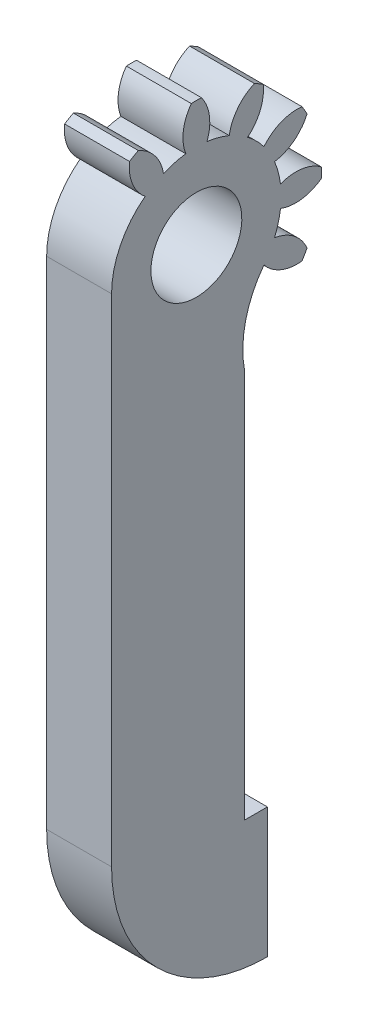
ISO-10303-21;
HEADER;
FILE_DESCRIPTION(('STEP AP214'),'2;1');
FILE_NAME('part.step','',(''),(''),'','','');
FILE_SCHEMA(('AUTOMOTIVE_DESIGN { 1 0 10303 214 1 1 1 1 }'));
ENDSEC;
DATA;
#1=APPLICATION_CONTEXT('core data for automotive mechanical design processes');
#2=APPLICATION_PROTOCOL_DEFINITION('international standard','automotive_design',2000,#1);
#3=PRODUCT_CONTEXT('',#1,'mechanical');
#4=PRODUCT('Part','Part','',(#3));
#5=PRODUCT_RELATED_PRODUCT_CATEGORY('part','',(#4));
#6=PRODUCT_DEFINITION_FORMATION('','',#4);
#7=PRODUCT_DEFINITION_CONTEXT('part definition',#1,'design');
#8=PRODUCT_DEFINITION('design','',#6,#7);
#9=PRODUCT_DEFINITION_SHAPE('','',#8);
#10=(LENGTH_UNIT() NAMED_UNIT(*) SI_UNIT(.MILLI.,.METRE.));
#11=(NAMED_UNIT(*) PLANE_ANGLE_UNIT() SI_UNIT($,.RADIAN.));
#12=(NAMED_UNIT(*) SI_UNIT($,.STERADIAN.) SOLID_ANGLE_UNIT());
#13=UNCERTAINTY_MEASURE_WITH_UNIT(LENGTH_MEASURE(1.E-05),#10,'distance_accuracy_value','');
#14=(GEOMETRIC_REPRESENTATION_CONTEXT(3) GLOBAL_UNCERTAINTY_ASSIGNED_CONTEXT((#13)) GLOBAL_UNIT_ASSIGNED_CONTEXT((#10,
#11,#12)) REPRESENTATION_CONTEXT('',''));
#15=CARTESIAN_POINT('',(0.,0.,0.));
#16=DIRECTION('',(0.,0.,1.));
#17=DIRECTION('',(1.,0.,0.));
#18=AXIS2_PLACEMENT_3D('',#15,#16,#17);
#19=CARTESIAN_POINT('',(2.5,0.21854177315367,0.0585580916289989));
#20=DIRECTION('',(-1.,0.,0.));
#21=DIRECTION('',(0.,-0.258819045102521,0.965925826289068));
#22=AXIS2_PLACEMENT_3D('',#19,#20,#21);
#23=CYLINDRICAL_SURFACE('',#22,6.53025);
#24=CARTESIAN_POINT('',(-2.5,0.21854177315367,0.0585580916289989));
#25=DIRECTION('',(-1.,0.,0.));
#26=DIRECTION('',(0.,0.707106781186549,-0.707106781186546));
#27=AXIS2_PLACEMENT_3D('',#24,#25,#26);
#28=CIRCLE('',#27,6.53025);
#29=CARTESIAN_POINT('',(-2.5,0.218541773153625,6.588808091629));
#30=VERTEX_POINT('',#29);
#31=CARTESIAN_POINT('',(-2.5,5.42161580746114,4.00471896721623));
#32=VERTEX_POINT('',#31);
#33=EDGE_CURVE('E258',#30,#32,#28,.T.);
#34=ORIENTED_EDGE('',*,*,#33,.F.);
#35=DIRECTION('',(1.,0.,0.));
#36=VECTOR('',#35,1.);
#37=CARTESIAN_POINT('',(-54.1323729633064,0.218541773153625,6.588808091629));
#38=LINE('',#37,#36);
#39=CARTESIAN_POINT('',(2.5,0.218541773153625,6.588808091629));
#40=VERTEX_POINT('',#39);
#41=EDGE_CURVE('E243',#30,#40,#38,.T.);
#42=ORIENTED_EDGE('',*,*,#41,.T.);
#43=CARTESIAN_POINT('',(2.5,0.21854177315367,0.0585580916289989));
#44=DIRECTION('',(-1.,0.,0.));
#45=DIRECTION('',(0.,0.707106781186549,-0.707106781186546));
#46=AXIS2_PLACEMENT_3D('',#43,#44,#45);
#47=CIRCLE('',#46,6.53025);
#48=CARTESIAN_POINT('',(2.5,5.42161580746114,4.00471896721623));
#49=VERTEX_POINT('',#48);
#50=EDGE_CURVE('E256',#40,#49,#47,.T.);
#51=ORIENTED_EDGE('',*,*,#50,.T.);
#52=DIRECTION('',(-1.,0.,0.));
#53=VECTOR('',#52,1.);
#54=CARTESIAN_POINT('',(2.5,5.42161580746114,4.00471896721623));
#55=LINE('',#54,#53);
#56=EDGE_CURVE('E266',#49,#32,#55,.T.);
#57=ORIENTED_EDGE('',*,*,#56,.T.);
#58=EDGE_LOOP('',(#34,#42,#51,#57));
#59=FACE_BOUND('',#58,.T.);
#60=ADVANCED_FACE('F39',(#59),#23,.T.);
#61=CARTESIAN_POINT('',(2.5,0.21854177315367,0.0585580916289989));
#62=DIRECTION('',(-1.,0.,0.));
#63=DIRECTION('',(0.,-0.258819045102521,0.965925826289068));
#64=AXIS2_PLACEMENT_3D('',#61,#62,#63);
#65=PLANE('',#64);
#66=CARTESIAN_POINT('',(2.5,0.21854177315367,0.0585580916289989));
#67=DIRECTION('',(-1.,0.,0.));
#68=DIRECTION('',(0.,-0.258819045102521,0.965925826289068));
#69=AXIS2_PLACEMENT_3D('',#66,#67,#68);
#70=CIRCLE('',#69,3.5);
#71=CARTESIAN_POINT('',(2.5,-0.687324884705155,3.43929848364074));
#72=VERTEX_POINT('',#71);
#73=EDGE_CURVE('E509',#72,#72,#70,.F.);
#74=ORIENTED_EDGE('',*,*,#73,.F.);
#75=EDGE_LOOP('',(#74));
#76=FACE_BOUND('',#75,.T.);
#77=ORIENTED_EDGE('',*,*,#50,.F.);
#78=DIRECTION('',(0.,-1.,0.));
#79=VECTOR('',#78,1.);
#80=CARTESIAN_POINT('',(2.5,0.218541773153625,6.588808091629));
#81=LINE('',#80,#79);
#82=CARTESIAN_POINT('',(2.5,-38.,6.58880809162899));
#83=VERTEX_POINT('',#82);
#84=EDGE_CURVE('E239',#40,#83,#81,.T.);
#85=ORIENTED_EDGE('',*,*,#84,.T.);
#86=CARTESIAN_POINT('',(2.5,-38.,-5.41119190837101));
#87=DIRECTION('',(1.,0.,0.));
#88=DIRECTION('',(0.,0.,-1.));
#89=AXIS2_PLACEMENT_3D('',#86,#87,#88);
#90=CIRCLE('',#89,12.);
#91=CARTESIAN_POINT('',(2.5,-50.,-5.41119190837101));
#92=VERTEX_POINT('',#91);
#93=EDGE_CURVE('E252',#83,#92,#90,.T.);
#94=ORIENTED_EDGE('',*,*,#93,.T.);
#95=DIRECTION('',(0.,1.,0.));
#96=VECTOR('',#95,1.);
#97=CARTESIAN_POINT('',(2.5,-50.,-5.41119190837101));
#98=LINE('',#97,#96);
#99=CARTESIAN_POINT('',(2.5,-40.,-5.41119190837101));
#100=VERTEX_POINT('',#99);
#101=EDGE_CURVE('E916',#92,#100,#98,.T.);
#102=ORIENTED_EDGE('',*,*,#101,.T.);
#103=DIRECTION('',(0.,0.,1.));
#104=VECTOR('',#103,1.);
#105=CARTESIAN_POINT('',(2.5,-40.,-5.41119190837101));
#106=LINE('',#105,#104);
#107=CARTESIAN_POINT('',(2.5,-40.,-3.66119190837101));
#108=VERTEX_POINT('',#107);
#109=EDGE_CURVE('E935',#100,#108,#106,.T.);
#110=ORIENTED_EDGE('',*,*,#109,.T.);
#111=DIRECTION('',(0.,1.,0.));
#112=VECTOR('',#111,1.);
#113=CARTESIAN_POINT('',(2.5,-40.,-3.66119190837101));
#114=LINE('',#113,#112);
#115=CARTESIAN_POINT('',(2.5,-10.065458499345,-3.66119190837101));
#116=VERTEX_POINT('',#115);
#117=EDGE_CURVE('E931',#108,#116,#114,.T.);
#118=ORIENTED_EDGE('',*,*,#117,.T.);
#119=CARTESIAN_POINT('',(2.5,-8.5619343284505,-11.5186351991327));
#120=DIRECTION('',(-1.,0.,0.));
#121=DIRECTION('',(0.,0.,-1.));
#122=AXIS2_PLACEMENT_3D('',#119,#120,#121);
#123=CIRCLE('',#122,8.);
#124=CARTESIAN_POINT('',(2.5,-3.72761910243351,-5.14451594267851));
#125=VERTEX_POINT('',#124);
#126=EDGE_CURVE('E260',#116,#125,#123,.T.);
#127=ORIENTED_EDGE('',*,*,#126,.T.);
#128=CARTESIAN_POINT('',(2.5,-1.64868784143815,-7.70733564216114));
#129=DIRECTION('',(-1.,0.,0.));
#130=DIRECTION('',(0.,-0.707106781186554,0.707106781186541));
#131=AXIS2_PLACEMENT_3D('',#128,#129,#130);
#132=CIRCLE('',#131,3.3);
#133=CARTESIAN_POINT('',(2.5,-4.9281610604673,-8.07483449341188));
#134=VERTEX_POINT('',#133);
#135=EDGE_CURVE('E415',#134,#125,#132,.T.);
#136=ORIENTED_EDGE('',*,*,#135,.F.);
#137=CARTESIAN_POINT('',(2.5,0.21854177315367,0.0585580916289989));
#138=DIRECTION('',(-1.,0.,0.));
#139=DIRECTION('',(0.,-0.258819045102521,0.965925826289068));
#140=AXIS2_PLACEMENT_3D('',#137,#138,#139);
#141=CIRCLE('',#140,9.625);
#142=CARTESIAN_POINT('',(2.5,-4.25183140763307,-8.46531360053664));
#143=VERTEX_POINT('',#142);
#144=EDGE_CURVE('E329',#143,#134,#141,.T.);
#145=ORIENTED_EDGE('',*,*,#144,.F.);
#146=CARTESIAN_POINT('',(2.5,-5.57330467610297,-5.44145705620133));
#147=DIRECTION('',(-1.,0.,0.));
#148=DIRECTION('',(0.,-0.965925826289071,0.258819045102511));
#149=AXIS2_PLACEMENT_3D('',#146,#147,#148);
#150=CIRCLE('',#149,3.3);
#151=CARTESIAN_POINT('',(2.5,-2.31437208053411,-5.96045449120354));
#152=VERTEX_POINT('',#151);
#153=EDGE_CURVE('E412',#152,#143,#150,.T.);
#154=ORIENTED_EDGE('',*,*,#153,.F.);
#155=CARTESIAN_POINT('',(2.5,0.21854177315367,0.0585580916289989));
#156=DIRECTION('',(-1.,0.,0.));
#157=DIRECTION('',(0.,-0.965925826289071,0.258819045102511));
#158=AXIS2_PLACEMENT_3D('',#155,#156,#157);
#159=CIRCLE('',#158,6.53025);
#160=CARTESIAN_POINT('',(2.5,-0.597396775371313,-6.42051663764608));
#161=VERTEX_POINT('',#160);
#162=EDGE_CURVE('E524',#161,#152,#159,.T.);
#163=ORIENTED_EDGE('',*,*,#162,.F.);
#164=CARTESIAN_POINT('',(2.5,2.4844203591136,-7.60051797221956));
#165=DIRECTION('',(-1.,0.,0.));
#166=DIRECTION('',(0.,-0.965925826289071,0.258819045102511));
#167=AXIS2_PLACEMENT_3D('',#164,#165,#166);
#168=CIRCLE('',#167,3.3);
#169=CARTESIAN_POINT('',(2.5,-0.171937333971,-9.55851792277887));
#170=VERTEX_POINT('',#169);
#171=EDGE_CURVE('E520',#170,#161,#168,.T.);
#172=ORIENTED_EDGE('',*,*,#171,.F.);
#173=CARTESIAN_POINT('',(2.5,0.609020880278542,-9.55851792277886));
#174=VERTEX_POINT('',#173);
#175=EDGE_CURVE('E417',#174,#170,#141,.T.);
#176=ORIENTED_EDGE('',*,*,#175,.F.);
#177=CARTESIAN_POINT('',(2.5,-2.0473368128061,-7.60051797221961));
#178=DIRECTION('',(-1.,0.,0.));
#179=DIRECTION('',(0.,-0.965925826289065,-0.258819045102531));
#180=AXIS2_PLACEMENT_3D('',#177,#178,#179);
#181=CIRCLE('',#180,3.3);
#182=CARTESIAN_POINT('',(2.5,1.03448032167879,-6.42051663764606));
#183=VERTEX_POINT('',#182);
#184=EDGE_CURVE('E542',#183,#174,#181,.T.);
#185=ORIENTED_EDGE('',*,*,#184,.F.);
#186=CARTESIAN_POINT('',(2.5,0.21854177315367,0.0585580916289989));
#187=DIRECTION('',(-1.,0.,0.));
#188=DIRECTION('',(0.,-0.965925826289065,-0.258819045102531));
#189=AXIS2_PLACEMENT_3D('',#186,#187,#188);
#190=CIRCLE('',#189,6.53025);
#191=CARTESIAN_POINT('',(2.5,2.75145562684158,-5.96045449120349));
#192=VERTEX_POINT('',#191);
#193=EDGE_CURVE('E549',#192,#183,#190,.T.);
#194=ORIENTED_EDGE('',*,*,#193,.F.);
#195=CARTESIAN_POINT('',(2.5,6.01038822241042,-5.44145705620121));
#196=DIRECTION('',(-1.,0.,0.));
#197=DIRECTION('',(0.,-0.965925826289065,-0.258819045102531));
#198=AXIS2_PLACEMENT_3D('',#195,#196,#197);
#199=CIRCLE('',#198,3.3);
#200=CARTESIAN_POINT('',(2.5,4.68891495394058,-8.46531360053655));
#201=VERTEX_POINT('',#200);
#202=EDGE_CURVE('E545',#201,#192,#199,.T.);
#203=ORIENTED_EDGE('',*,*,#202,.F.);
#204=CARTESIAN_POINT('',(2.5,5.36524460677481,-8.07483449341177));
#205=VERTEX_POINT('',#204);
#206=EDGE_CURVE('E395',#205,#201,#141,.T.);
#207=ORIENTED_EDGE('',*,*,#206,.F.);
#208=CARTESIAN_POINT('',(2.5,2.08577138774566,-7.7073356421611));
#209=DIRECTION('',(-1.,0.,0.));
#210=DIRECTION('',(0.,-0.707106781186539,-0.707106781186556));
#211=AXIS2_PLACEMENT_3D('',#208,#209,#210);
#212=CIRCLE('',#211,3.3);
#213=CARTESIAN_POINT('',(2.5,4.16470264874096,-5.14451594267842));
#214=VERTEX_POINT('',#213);
#215=EDGE_CURVE('E444',#214,#205,#212,.T.);
#216=ORIENTED_EDGE('',*,*,#215,.F.);
#217=CARTESIAN_POINT('',(2.5,0.21854177315367,0.0585580916289989));
#218=DIRECTION('',(-1.,0.,0.));
#219=DIRECTION('',(0.,-0.707106781186539,-0.707106781186556));
#220=AXIS2_PLACEMENT_3D('',#217,#218,#219);
#221=CIRCLE('',#220,6.53025);
#222=CARTESIAN_POINT('',(2.5,5.42161580746119,-3.88760278395816));
#223=VERTEX_POINT('',#222);
#224=EDGE_CURVE('E440',#223,#214,#221,.T.);
#225=ORIENTED_EDGE('',*,*,#224,.F.);
#226=CARTESIAN_POINT('',(2.5,7.98443550694382,-1.8086715229628));
#227=DIRECTION('',(-1.,0.,0.));
#228=DIRECTION('',(0.,-0.707106781186539,-0.707106781186556));
#229=AXIS2_PLACEMENT_3D('',#226,#227,#228);
#230=CIRCLE('',#229,3.3);
#231=CARTESIAN_POINT('',(2.5,8.35193435819456,-5.08814474199195));
#232=VERTEX_POINT('',#231);
#233=EDGE_CURVE('E438',#232,#223,#230,.T.);
#234=ORIENTED_EDGE('',*,*,#233,.F.);
#235=CARTESIAN_POINT('',(2.5,8.74241346531932,-4.41181508915771));
#236=VERTEX_POINT('',#235);
#237=EDGE_CURVE('E328',#236,#232,#141,.T.);
#238=ORIENTED_EDGE('',*,*,#237,.F.);
#239=CARTESIAN_POINT('',(2.5,5.71855692098402,-5.73328835762762));
#240=DIRECTION('',(-1.,0.,0.));
#241=DIRECTION('',(0.,-0.258819045102508,-0.965925826289072));
#242=AXIS2_PLACEMENT_3D('',#239,#240,#241);
#243=CIRCLE('',#242,3.3);
#244=CARTESIAN_POINT('',(2.5,6.23755435598622,-2.47435576205876));
#245=VERTEX_POINT('',#244);
#246=EDGE_CURVE('E436',#245,#236,#243,.T.);
#247=ORIENTED_EDGE('',*,*,#246,.F.);
#248=CARTESIAN_POINT('',(2.5,0.21854177315367,0.0585580916289989));
#249=DIRECTION('',(-1.,0.,0.));
#250=DIRECTION('',(0.,-0.258819045102508,-0.965925826289072));
#251=AXIS2_PLACEMENT_3D('',#248,#249,#250);
#252=CIRCLE('',#251,6.53025);
#253=CARTESIAN_POINT('',(2.5,6.69761650242875,-0.757380456895961));
#254=VERTEX_POINT('',#253);
#255=EDGE_CURVE('E480',#254,#245,#252,.T.);
#256=ORIENTED_EDGE('',*,*,#255,.F.);
#257=CARTESIAN_POINT('',(2.5,7.87761783700222,2.32443667758896));
#258=DIRECTION('',(-1.,0.,0.));
#259=DIRECTION('',(0.,-0.258819045102508,-0.965925826289072));
#260=AXIS2_PLACEMENT_3D('',#257,#258,#259);
#261=CIRCLE('',#260,3.3);
#262=CARTESIAN_POINT('',(2.5,9.83561778756154,-0.331921015495636));
#263=VERTEX_POINT('',#262);
#264=EDGE_CURVE('E473',#263,#254,#261,.T.);
#265=ORIENTED_EDGE('',*,*,#264,.F.);
#266=CARTESIAN_POINT('',(2.5,9.83561778756154,0.44903719875377));
#267=VERTEX_POINT('',#266);
#268=EDGE_CURVE('E323',#267,#263,#141,.T.);
#269=ORIENTED_EDGE('',*,*,#268,.F.);
#270=CARTESIAN_POINT('',(2.5,7.87761783700225,-2.20732049433086));
#271=DIRECTION('',(-1.,0.,0.));
#272=DIRECTION('',(0.,0.258819045102521,-0.965925826289068));
#273=AXIS2_PLACEMENT_3D('',#270,#271,#272);
#274=CIRCLE('',#273,3.3);
#275=CARTESIAN_POINT('',(2.5,6.69761650242874,0.874496640154049));
#276=VERTEX_POINT('',#275);
#277=EDGE_CURVE('E285',#276,#267,#274,.T.);
#278=ORIENTED_EDGE('',*,*,#277,.F.);
#279=CARTESIAN_POINT('',(2.5,0.21854177315367,0.0585580916289989));
#280=DIRECTION('',(-1.,0.,0.));
#281=DIRECTION('',(0.,0.258819045102521,-0.965925826289068));
#282=AXIS2_PLACEMENT_3D('',#279,#280,#281);
#283=CIRCLE('',#282,6.53025);
#284=CARTESIAN_POINT('',(2.5,6.23755435598619,2.59147194531685));
#285=VERTEX_POINT('',#284);
#286=EDGE_CURVE('E292',#285,#276,#283,.T.);
#287=ORIENTED_EDGE('',*,*,#286,.F.);
#288=CARTESIAN_POINT('',(2.5,5.71855692098393,5.85040454088569));
#289=DIRECTION('',(-1.,0.,0.));
#290=DIRECTION('',(0.,0.258819045102521,-0.965925826289068));
#291=AXIS2_PLACEMENT_3D('',#288,#289,#290);
#292=CIRCLE('',#291,3.3);
#293=CARTESIAN_POINT('',(2.5,8.74241346531926,4.52893127241582));
#294=VERTEX_POINT('',#293);
#295=EDGE_CURVE('E288',#294,#285,#292,.T.);
#296=ORIENTED_EDGE('',*,*,#295,.F.);
#297=CARTESIAN_POINT('',(2.5,8.35193435819449,5.20526092525006));
#298=VERTEX_POINT('',#297);
#299=EDGE_CURVE('E320',#298,#294,#141,.T.);
#300=ORIENTED_EDGE('',*,*,#299,.F.);
#301=CARTESIAN_POINT('',(2.5,7.98443550694379,1.9257877062209));
#302=DIRECTION('',(-1.,0.,0.));
#303=DIRECTION('',(0.,0.707106781186549,-0.707106781186546));
#304=AXIS2_PLACEMENT_3D('',#301,#302,#303);
#305=CIRCLE('',#304,3.3);
#306=EDGE_CURVE('E264',#49,#298,#305,.T.);
#307=ORIENTED_EDGE('',*,*,#306,.F.);
#308=EDGE_LOOP('',(#77,#85,#94,#102,#110,#118,#127,#136,#145,#154,#163,#172,#176,#185,#194,#203,
#207,#216,#225,#234,#238,#247,#256,#265,#269,#278,#287,#296,#300,#307));
#309=FACE_BOUND('',#308,.T.);
#310=ADVANCED_FACE('F41',(#76,#309),#65,.F.);
#311=CARTESIAN_POINT('',(-12.5,0.21854177315367,0.0585580916289989));
#312=DIRECTION('',(-1.,0.,0.));
#313=DIRECTION('',(0.,-0.258819045102521,0.965925826289068));
#314=AXIS2_PLACEMENT_3D('',#311,#312,#313);
#315=CYLINDRICAL_SURFACE('',#314,9.625);
#316=DIRECTION('',(-1.,0.,0.));
#317=VECTOR('',#316,1.);
#318=CARTESIAN_POINT('',(0.,-4.25183140763307,-8.46531360053664));
#319=LINE('',#318,#317);
#320=CARTESIAN_POINT('',(-2.5,-4.25183140763307,-8.46531360053664));
#321=VERTEX_POINT('',#320);
#322=EDGE_CURVE('E279',#143,#321,#319,.T.);
#323=ORIENTED_EDGE('',*,*,#322,.F.);
#324=ORIENTED_EDGE('',*,*,#144,.T.);
#325=DIRECTION('',(-1.,0.,0.));
#326=VECTOR('',#325,1.);
#327=CARTESIAN_POINT('',(0.,-4.9281610604673,-8.07483449341188));
#328=LINE('',#327,#326);
#329=CARTESIAN_POINT('',(-2.5,-4.9281610604673,-8.07483449341188));
#330=VERTEX_POINT('',#329);
#331=EDGE_CURVE('E349',#330,#134,#328,.F.);
#332=ORIENTED_EDGE('',*,*,#331,.F.);
#333=CARTESIAN_POINT('',(-2.5,0.21854177315367,0.0585580916289989));
#334=DIRECTION('',(-1.,0.,0.));
#335=DIRECTION('',(0.,-0.258819045102521,0.965925826289068));
#336=AXIS2_PLACEMENT_3D('',#333,#334,#335);
#337=CIRCLE('',#336,9.625);
#338=EDGE_CURVE('E322',#321,#330,#337,.T.);
#339=ORIENTED_EDGE('',*,*,#338,.F.);
#340=EDGE_LOOP('',(#323,#324,#332,#339));
#341=FACE_BOUND('',#340,.T.);
#342=ADVANCED_FACE('F358',(#341),#315,.T.);
#343=DIRECTION('',(-1.,0.,0.));
#344=VECTOR('',#343,1.);
#345=CARTESIAN_POINT('',(0.,-0.171937333970999,-9.55851792277887));
#346=LINE('',#345,#344);
#347=CARTESIAN_POINT('',(-2.5,-0.171937333970999,-9.55851792277887));
#348=VERTEX_POINT('',#347);
#349=EDGE_CURVE('E361',#348,#170,#346,.F.);
#350=ORIENTED_EDGE('',*,*,#349,.F.);
#351=CARTESIAN_POINT('',(-2.5,0.60902088027854,-9.55851792277887));
#352=VERTEX_POINT('',#351);
#353=EDGE_CURVE('E367',#352,#348,#337,.T.);
#354=ORIENTED_EDGE('',*,*,#353,.F.);
#355=DIRECTION('',(-1.,0.,0.));
#356=VECTOR('',#355,1.);
#357=CARTESIAN_POINT('',(0.,0.609020880278541,-9.55851792277887));
#358=LINE('',#357,#356);
#359=EDGE_CURVE('E362',#174,#352,#358,.T.);
#360=ORIENTED_EDGE('',*,*,#359,.F.);
#361=ORIENTED_EDGE('',*,*,#175,.T.);
#362=EDGE_LOOP('',(#350,#354,#360,#361));
#363=FACE_BOUND('',#362,.T.);
#364=ADVANCED_FACE('F618',(#363),#315,.T.);
#365=DIRECTION('',(-1.,0.,0.));
#366=VECTOR('',#365,1.);
#367=CARTESIAN_POINT('',(0.,4.68891495394059,-8.46531360053655));
#368=LINE('',#367,#366);
#369=CARTESIAN_POINT('',(-2.5,4.68891495394058,-8.46531360053655));
#370=VERTEX_POINT('',#369);
#371=EDGE_CURVE('E394',#370,#201,#368,.F.);
#372=ORIENTED_EDGE('',*,*,#371,.F.);
#373=CARTESIAN_POINT('',(-2.5,5.36524460677481,-8.07483449341177));
#374=VERTEX_POINT('',#373);
#375=EDGE_CURVE('E371',#374,#370,#337,.T.);
#376=ORIENTED_EDGE('',*,*,#375,.F.);
#377=DIRECTION('',(-1.,0.,0.));
#378=VECTOR('',#377,1.);
#379=CARTESIAN_POINT('',(0.,5.36524460677481,-8.07483449341177));
#380=LINE('',#379,#378);
#381=EDGE_CURVE('E392',#205,#374,#380,.T.);
#382=ORIENTED_EDGE('',*,*,#381,.F.);
#383=ORIENTED_EDGE('',*,*,#206,.T.);
#384=EDGE_LOOP('',(#372,#376,#382,#383));
#385=FACE_BOUND('',#384,.T.);
#386=ADVANCED_FACE('F390',(#385),#315,.T.);
#387=DIRECTION('',(-1.,0.,0.));
#388=VECTOR('',#387,1.);
#389=CARTESIAN_POINT('',(0.,8.74241346531933,-4.41181508915771));
#390=LINE('',#389,#388);
#391=CARTESIAN_POINT('',(-2.5,8.74241346531933,-4.41181508915771));
#392=VERTEX_POINT('',#391);
#393=EDGE_CURVE('E399',#236,#392,#390,.T.);
#394=ORIENTED_EDGE('',*,*,#393,.F.);
#395=ORIENTED_EDGE('',*,*,#237,.T.);
#396=DIRECTION('',(-1.,0.,0.));
#397=VECTOR('',#396,1.);
#398=CARTESIAN_POINT('',(0.,8.35193435819456,-5.08814474199195));
#399=LINE('',#398,#397);
#400=CARTESIAN_POINT('',(-2.5,8.35193435819456,-5.08814474199195));
#401=VERTEX_POINT('',#400);
#402=EDGE_CURVE('E432',#401,#232,#399,.F.);
#403=ORIENTED_EDGE('',*,*,#402,.F.);
#404=EDGE_CURVE('E321',#392,#401,#337,.T.);
#405=ORIENTED_EDGE('',*,*,#404,.F.);
#406=EDGE_LOOP('',(#394,#395,#403,#405));
#407=FACE_BOUND('',#406,.T.);
#408=ADVANCED_FACE('F431',(#407),#315,.T.);
#409=DIRECTION('',(-1.,0.,0.));
#410=VECTOR('',#409,1.);
#411=CARTESIAN_POINT('',(0.,9.83561778756154,-0.331921015495637));
#412=LINE('',#411,#410);
#413=CARTESIAN_POINT('',(-2.5,9.83561778756154,-0.331921015495638));
#414=VERTEX_POINT('',#413);
#415=EDGE_CURVE('E404',#414,#263,#412,.F.);
#416=ORIENTED_EDGE('',*,*,#415,.F.);
#417=CARTESIAN_POINT('',(-2.5,9.83561778756154,0.449037198753769));
#418=VERTEX_POINT('',#417);
#419=EDGE_CURVE('E316',#418,#414,#337,.T.);
#420=ORIENTED_EDGE('',*,*,#419,.F.);
#421=DIRECTION('',(-1.,0.,0.));
#422=VECTOR('',#421,1.);
#423=CARTESIAN_POINT('',(0.,9.83561778756154,0.44903719875377));
#424=LINE('',#423,#422);
#425=EDGE_CURVE('E312',#267,#418,#424,.T.);
#426=ORIENTED_EDGE('',*,*,#425,.F.);
#427=ORIENTED_EDGE('',*,*,#268,.T.);
#428=EDGE_LOOP('',(#416,#420,#426,#427));
#429=FACE_BOUND('',#428,.T.);
#430=ADVANCED_FACE('F484',(#429),#315,.T.);
#431=CARTESIAN_POINT('',(-2.5,0.21854177315367,0.0585580916289989));
#432=DIRECTION('',(1.,0.,0.));
#433=DIRECTION('',(0.,0.258819045102521,-0.965925826289068));
#434=AXIS2_PLACEMENT_3D('',#431,#432,#433);
#435=PLANE('',#434);
#436=CARTESIAN_POINT('',(-2.5,0.21854177315367,0.0585580916289989));
#437=DIRECTION('',(1.,0.,0.));
#438=DIRECTION('',(0.,0.258819045102521,-0.965925826289068));
#439=AXIS2_PLACEMENT_3D('',#436,#437,#438);
#440=CIRCLE('',#439,3.5);
#441=CARTESIAN_POINT('',(-2.5,1.12440843101249,-3.32218230038274));
#442=VERTEX_POINT('',#441);
#443=EDGE_CURVE('E43',#442,#442,#440,.F.);
#444=ORIENTED_EDGE('',*,*,#443,.F.);
#445=EDGE_LOOP('',(#444));
#446=FACE_BOUND('',#445,.T.);
#447=CARTESIAN_POINT('',(-2.5,-1.64868784143815,-7.70733564216114));
#448=DIRECTION('',(1.,0.,0.));
#449=DIRECTION('',(0.,0.258819045102521,-0.965925826289068));
#450=AXIS2_PLACEMENT_3D('',#447,#448,#449);
#451=CIRCLE('',#450,3.3);
#452=CARTESIAN_POINT('',(-2.5,-3.72761910243351,-5.14451594267851));
#453=VERTEX_POINT('',#452);
#454=EDGE_CURVE('E49',#453,#330,#451,.T.);
#455=ORIENTED_EDGE('',*,*,#454,.F.);
#456=CARTESIAN_POINT('',(-2.5,-8.5619343284505,-11.5186351991327));
#457=DIRECTION('',(1.,0.,0.));
#458=DIRECTION('',(0.,0.,-1.));
#459=AXIS2_PLACEMENT_3D('',#456,#457,#458);
#460=CIRCLE('',#459,8.);
#461=CARTESIAN_POINT('',(-2.5,-10.065458499345,-3.66119190837101));
#462=VERTEX_POINT('',#461);
#463=EDGE_CURVE('E504',#453,#462,#460,.T.);
#464=ORIENTED_EDGE('',*,*,#463,.T.);
#465=DIRECTION('',(0.,-1.,0.));
#466=VECTOR('',#465,1.);
#467=CARTESIAN_POINT('',(-2.5,-40.,-3.66119190837101));
#468=LINE('',#467,#466);
#469=CARTESIAN_POINT('',(-2.5,-40.,-3.66119190837101));
#470=VERTEX_POINT('',#469);
#471=EDGE_CURVE('E510',#462,#470,#468,.T.);
#472=ORIENTED_EDGE('',*,*,#471,.T.);
#473=DIRECTION('',(0.,0.,-1.));
#474=VECTOR('',#473,1.);
#475=CARTESIAN_POINT('',(-2.5,-40.,-5.41119190837101));
#476=LINE('',#475,#474);
#477=CARTESIAN_POINT('',(-2.5,-40.,-5.41119190837101));
#478=VERTEX_POINT('',#477);
#479=EDGE_CURVE('E945',#470,#478,#476,.T.);
#480=ORIENTED_EDGE('',*,*,#479,.T.);
#481=DIRECTION('',(0.,-1.,0.));
#482=VECTOR('',#481,1.);
#483=CARTESIAN_POINT('',(-2.5,-50.,-5.41119190837101));
#484=LINE('',#483,#482);
#485=CARTESIAN_POINT('',(-2.5,-50.,-5.41119190837101));
#486=VERTEX_POINT('',#485);
#487=EDGE_CURVE('E910',#478,#486,#484,.T.);
#488=ORIENTED_EDGE('',*,*,#487,.T.);
#489=CARTESIAN_POINT('',(-2.5,-38.,-5.41119190837101));
#490=DIRECTION('',(1.,0.,0.));
#491=DIRECTION('',(0.,0.,-1.));
#492=AXIS2_PLACEMENT_3D('',#489,#490,#491);
#493=CIRCLE('',#492,12.);
#494=CARTESIAN_POINT('',(-2.5,-38.,6.58880809162899));
#495=VERTEX_POINT('',#494);
#496=EDGE_CURVE('E502',#486,#495,#493,.F.);
#497=ORIENTED_EDGE('',*,*,#496,.T.);
#498=DIRECTION('',(0.,1.,0.));
#499=VECTOR('',#498,1.);
#500=CARTESIAN_POINT('',(-2.5,0.218541773153625,6.588808091629));
#501=LINE('',#500,#499);
#502=EDGE_CURVE('E500',#495,#30,#501,.T.);
#503=ORIENTED_EDGE('',*,*,#502,.T.);
#504=ORIENTED_EDGE('',*,*,#33,.T.);
#505=CARTESIAN_POINT('',(-2.5,7.98443550694379,1.9257877062209));
#506=DIRECTION('',(-1.,0.,0.));
#507=DIRECTION('',(0.,0.707106781186549,-0.707106781186546));
#508=AXIS2_PLACEMENT_3D('',#505,#506,#507);
#509=CIRCLE('',#508,3.3);
#510=CARTESIAN_POINT('',(-2.5,8.35193435819449,5.20526092525006));
#511=VERTEX_POINT('',#510);
#512=EDGE_CURVE('E275',#32,#511,#509,.T.);
#513=ORIENTED_EDGE('',*,*,#512,.T.);
#514=CARTESIAN_POINT('',(-2.5,8.74241346531926,4.52893127241583));
#515=VERTEX_POINT('',#514);
#516=EDGE_CURVE('E315',#511,#515,#337,.T.);
#517=ORIENTED_EDGE('',*,*,#516,.T.);
#518=CARTESIAN_POINT('',(-2.5,5.71855692098393,5.85040454088569));
#519=DIRECTION('',(1.,0.,0.));
#520=DIRECTION('',(0.,0.258819045102521,-0.965925826289068));
#521=AXIS2_PLACEMENT_3D('',#518,#519,#520);
#522=CIRCLE('',#521,3.3);
#523=CARTESIAN_POINT('',(-2.5,6.23755435598619,2.59147194531685));
#524=VERTEX_POINT('',#523);
#525=EDGE_CURVE('E327',#524,#515,#522,.T.);
#526=ORIENTED_EDGE('',*,*,#525,.F.);
#527=CARTESIAN_POINT('',(-2.5,0.21854177315367,0.0585580916289989));
#528=DIRECTION('',(-1.,0.,0.));
#529=DIRECTION('',(0.,0.258819045102521,-0.965925826289068));
#530=AXIS2_PLACEMENT_3D('',#527,#528,#529);
#531=CIRCLE('',#530,6.53025);
#532=CARTESIAN_POINT('',(-2.5,6.69761650242874,0.874496640154049));
#533=VERTEX_POINT('',#532);
#534=EDGE_CURVE('E289',#524,#533,#531,.T.);
#535=ORIENTED_EDGE('',*,*,#534,.T.);
#536=CARTESIAN_POINT('',(-2.5,7.87761783700225,-2.20732049433086));
#537=DIRECTION('',(-1.,0.,0.));
#538=DIRECTION('',(0.,0.258819045102521,-0.965925826289068));
#539=AXIS2_PLACEMENT_3D('',#536,#537,#538);
#540=CIRCLE('',#539,3.3);
#541=EDGE_CURVE('E284',#533,#418,#540,.T.);
#542=ORIENTED_EDGE('',*,*,#541,.T.);
#543=ORIENTED_EDGE('',*,*,#419,.T.);
#544=CARTESIAN_POINT('',(-2.5,7.87761783700222,2.32443667758896));
#545=DIRECTION('',(1.,0.,0.));
#546=DIRECTION('',(0.,0.258819045102521,-0.965925826289068));
#547=AXIS2_PLACEMENT_3D('',#544,#545,#546);
#548=CIRCLE('',#547,3.3);
#549=CARTESIAN_POINT('',(-2.5,6.69761650242875,-0.757380456895961));
#550=VERTEX_POINT('',#549);
#551=EDGE_CURVE('E336',#550,#414,#548,.T.);
#552=ORIENTED_EDGE('',*,*,#551,.F.);
#553=CARTESIAN_POINT('',(-2.5,0.21854177315367,0.0585580916289989));
#554=DIRECTION('',(-1.,0.,0.));
#555=DIRECTION('',(0.,-0.258819045102508,-0.965925826289072));
#556=AXIS2_PLACEMENT_3D('',#553,#554,#555);
#557=CIRCLE('',#556,6.53025);
#558=CARTESIAN_POINT('',(-2.5,6.23755435598622,-2.47435576205876));
#559=VERTEX_POINT('',#558);
#560=EDGE_CURVE('E562',#550,#559,#557,.T.);
#561=ORIENTED_EDGE('',*,*,#560,.T.);
#562=CARTESIAN_POINT('',(-2.5,5.71855692098402,-5.73328835762762));
#563=DIRECTION('',(-1.,0.,0.));
#564=DIRECTION('',(0.,-0.258819045102508,-0.965925826289072));
#565=AXIS2_PLACEMENT_3D('',#562,#563,#564);
#566=CIRCLE('',#565,3.3);
#567=EDGE_CURVE('E517',#559,#392,#566,.T.);
#568=ORIENTED_EDGE('',*,*,#567,.T.);
#569=ORIENTED_EDGE('',*,*,#404,.T.);
#570=CARTESIAN_POINT('',(-2.5,7.98443550694382,-1.8086715229628));
#571=DIRECTION('',(1.,0.,0.));
#572=DIRECTION('',(0.,0.258819045102521,-0.965925826289068));
#573=AXIS2_PLACEMENT_3D('',#570,#571,#572);
#574=CIRCLE('',#573,3.3);
#575=CARTESIAN_POINT('',(-2.5,5.42161580746119,-3.88760278395816));
#576=VERTEX_POINT('',#575);
#577=EDGE_CURVE('E333',#576,#401,#574,.T.);
#578=ORIENTED_EDGE('',*,*,#577,.F.);
#579=CARTESIAN_POINT('',(-2.5,0.21854177315367,0.0585580916289989));
#580=DIRECTION('',(-1.,0.,0.));
#581=DIRECTION('',(0.,-0.707106781186539,-0.707106781186556));
#582=AXIS2_PLACEMENT_3D('',#579,#580,#581);
#583=CIRCLE('',#582,6.53025);
#584=CARTESIAN_POINT('',(-2.5,4.16470264874096,-5.14451594267842));
#585=VERTEX_POINT('',#584);
#586=EDGE_CURVE('E450',#576,#585,#583,.T.);
#587=ORIENTED_EDGE('',*,*,#586,.T.);
#588=CARTESIAN_POINT('',(-2.5,2.08577138774566,-7.7073356421611));
#589=DIRECTION('',(-1.,0.,0.));
#590=DIRECTION('',(0.,-0.707106781186539,-0.707106781186556));
#591=AXIS2_PLACEMENT_3D('',#588,#589,#590);
#592=CIRCLE('',#591,3.3);
#593=EDGE_CURVE('E386',#585,#374,#592,.T.);
#594=ORIENTED_EDGE('',*,*,#593,.T.);
#595=ORIENTED_EDGE('',*,*,#375,.T.);
#596=CARTESIAN_POINT('',(-2.5,6.01038822241042,-5.44145705620121));
#597=DIRECTION('',(1.,0.,0.));
#598=DIRECTION('',(0.,0.258819045102521,-0.965925826289068));
#599=AXIS2_PLACEMENT_3D('',#596,#597,#598);
#600=CIRCLE('',#599,3.3);
#601=CARTESIAN_POINT('',(-2.5,2.75145562684158,-5.96045449120349));
#602=VERTEX_POINT('',#601);
#603=EDGE_CURVE('E339',#602,#370,#600,.T.);
#604=ORIENTED_EDGE('',*,*,#603,.F.);
#605=CARTESIAN_POINT('',(-2.5,0.21854177315367,0.0585580916289989));
#606=DIRECTION('',(-1.,0.,0.));
#607=DIRECTION('',(0.,-0.965925826289065,-0.258819045102531));
#608=AXIS2_PLACEMENT_3D('',#605,#606,#607);
#609=CIRCLE('',#608,6.53025);
#610=CARTESIAN_POINT('',(-2.5,1.03448032167879,-6.42051663764606));
#611=VERTEX_POINT('',#610);
#612=EDGE_CURVE('E546',#602,#611,#609,.T.);
#613=ORIENTED_EDGE('',*,*,#612,.T.);
#614=CARTESIAN_POINT('',(-2.5,-2.0473368128061,-7.60051797221961));
#615=DIRECTION('',(-1.,0.,0.));
#616=DIRECTION('',(0.,-0.965925826289065,-0.258819045102531));
#617=AXIS2_PLACEMENT_3D('',#614,#615,#616);
#618=CIRCLE('',#617,3.3);
#619=EDGE_CURVE('E64',#611,#352,#618,.T.);
#620=ORIENTED_EDGE('',*,*,#619,.T.);
#621=ORIENTED_EDGE('',*,*,#353,.T.);
#622=CARTESIAN_POINT('',(-2.5,2.4844203591136,-7.60051797221956));
#623=DIRECTION('',(1.,0.,0.));
#624=DIRECTION('',(0.,0.258819045102521,-0.965925826289068));
#625=AXIS2_PLACEMENT_3D('',#622,#623,#624);
#626=CIRCLE('',#625,3.3);
#627=CARTESIAN_POINT('',(-2.5,-0.597396775371313,-6.42051663764608));
#628=VERTEX_POINT('',#627);
#629=EDGE_CURVE('E11',#628,#348,#626,.T.);
#630=ORIENTED_EDGE('',*,*,#629,.F.);
#631=CARTESIAN_POINT('',(-2.5,0.21854177315367,0.0585580916289989));
#632=DIRECTION('',(-1.,0.,0.));
#633=DIRECTION('',(0.,-0.965925826289071,0.258819045102511));
#634=AXIS2_PLACEMENT_3D('',#631,#632,#633);
#635=CIRCLE('',#634,6.53025);
#636=CARTESIAN_POINT('',(-2.5,-2.31437208053411,-5.96045449120354));
#637=VERTEX_POINT('',#636);
#638=EDGE_CURVE('E521',#628,#637,#635,.T.);
#639=ORIENTED_EDGE('',*,*,#638,.T.);
#640=CARTESIAN_POINT('',(-2.5,-5.57330467610297,-5.44145705620133));
#641=DIRECTION('',(-1.,0.,0.));
#642=DIRECTION('',(0.,-0.965925826289071,0.258819045102511));
#643=AXIS2_PLACEMENT_3D('',#640,#641,#642);
#644=CIRCLE('',#643,3.3);
#645=EDGE_CURVE('E56',#637,#321,#644,.T.);
#646=ORIENTED_EDGE('',*,*,#645,.T.);
#647=ORIENTED_EDGE('',*,*,#338,.T.);
#648=EDGE_LOOP('',(#455,#464,#472,#480,#488,#497,#503,#504,#513,#517,#526,#535,#542,#543,#552,
#561,#568,#569,#578,#587,#594,#595,#604,#613,#620,#621,#630,#639,#646,#647));
#649=FACE_BOUND('',#648,.T.);
#650=ADVANCED_FACE('F364',(#446,#649),#435,.F.);
#651=DIRECTION('',(-1.,0.,0.));
#652=VECTOR('',#651,1.);
#653=CARTESIAN_POINT('',(0.,8.35193435819449,5.20526092525006));
#654=LINE('',#653,#652);
#655=EDGE_CURVE('E270',#298,#511,#654,.T.);
#656=ORIENTED_EDGE('',*,*,#655,.F.);
#657=ORIENTED_EDGE('',*,*,#299,.T.);
#658=DIRECTION('',(-1.,0.,0.));
#659=VECTOR('',#658,1.);
#660=CARTESIAN_POINT('',(0.,8.74241346531926,4.52893127241583));
#661=LINE('',#660,#659);
#662=EDGE_CURVE('E308',#515,#294,#661,.F.);
#663=ORIENTED_EDGE('',*,*,#662,.F.);
#664=ORIENTED_EDGE('',*,*,#516,.F.);
#665=EDGE_LOOP('',(#656,#657,#663,#664));
#666=FACE_BOUND('',#665,.T.);
#667=ADVANCED_FACE('F496',(#666),#315,.T.);
#668=CARTESIAN_POINT('',(2.5,7.87761783700225,-2.20732049433086));
#669=DIRECTION('',(-1.,0.,0.));
#670=DIRECTION('',(0.,-0.258819045102521,0.965925826289068));
#671=AXIS2_PLACEMENT_3D('',#668,#669,#670);
#672=CYLINDRICAL_SURFACE('',#671,3.3);
#673=ORIENTED_EDGE('',*,*,#425,.T.);
#674=ORIENTED_EDGE('',*,*,#541,.F.);
#675=DIRECTION('',(-1.,0.,0.));
#676=VECTOR('',#675,1.);
#677=CARTESIAN_POINT('',(2.5,6.69761650242874,0.874496640154049));
#678=LINE('',#677,#676);
#679=EDGE_CURVE('E295',#276,#533,#678,.T.);
#680=ORIENTED_EDGE('',*,*,#679,.F.);
#681=ORIENTED_EDGE('',*,*,#277,.T.);
#682=EDGE_LOOP('',(#673,#674,#680,#681));
#683=FACE_BOUND('',#682,.T.);
#684=ADVANCED_FACE('F486',(#683),#672,.T.);
#685=CARTESIAN_POINT('',(2.5,5.71855692098393,5.85040454088569));
#686=DIRECTION('',(-1.,0.,0.));
#687=DIRECTION('',(0.,-0.258819045102521,0.965925826289068));
#688=AXIS2_PLACEMENT_3D('',#685,#686,#687);
#689=CYLINDRICAL_SURFACE('',#688,3.3);
#690=ORIENTED_EDGE('',*,*,#662,.T.);
#691=ORIENTED_EDGE('',*,*,#295,.T.);
#692=DIRECTION('',(-1.,0.,0.));
#693=VECTOR('',#692,1.);
#694=CARTESIAN_POINT('',(2.5,6.23755435598619,2.59147194531685));
#695=LINE('',#694,#693);
#696=EDGE_CURVE('E305',#285,#524,#695,.T.);
#697=ORIENTED_EDGE('',*,*,#696,.T.);
#698=ORIENTED_EDGE('',*,*,#525,.T.);
#699=EDGE_LOOP('',(#690,#691,#697,#698));
#700=FACE_BOUND('',#699,.T.);
#701=ADVANCED_FACE('F495',(#700),#689,.T.);
#702=CARTESIAN_POINT('',(2.5,0.21854177315367,0.0585580916289989));
#703=DIRECTION('',(-1.,0.,0.));
#704=DIRECTION('',(0.,-0.258819045102521,0.965925826289068));
#705=AXIS2_PLACEMENT_3D('',#702,#703,#704);
#706=CYLINDRICAL_SURFACE('',#705,6.53025);
#707=ORIENTED_EDGE('',*,*,#534,.F.);
#708=ORIENTED_EDGE('',*,*,#696,.F.);
#709=ORIENTED_EDGE('',*,*,#286,.T.);
#710=ORIENTED_EDGE('',*,*,#679,.T.);
#711=EDGE_LOOP('',(#707,#708,#709,#710));
#712=FACE_BOUND('',#711,.T.);
#713=ADVANCED_FACE('F491',(#712),#706,.T.);
#714=CARTESIAN_POINT('',(2.5,7.98443550694379,1.9257877062209));
#715=DIRECTION('',(-1.,0.,0.));
#716=DIRECTION('',(0.,-0.258819045102521,0.965925826289068));
#717=AXIS2_PLACEMENT_3D('',#714,#715,#716);
#718=CYLINDRICAL_SURFACE('',#717,3.3);
#719=ORIENTED_EDGE('',*,*,#655,.T.);
#720=ORIENTED_EDGE('',*,*,#512,.F.);
#721=ORIENTED_EDGE('',*,*,#56,.F.);
#722=ORIENTED_EDGE('',*,*,#306,.T.);
#723=EDGE_LOOP('',(#719,#720,#721,#722));
#724=FACE_BOUND('',#723,.T.);
#725=ADVANCED_FACE('F499',(#724),#718,.T.);
#726=CARTESIAN_POINT('',(2.5,2.08577138774566,-7.7073356421611));
#727=DIRECTION('',(-1.,0.,0.));
#728=DIRECTION('',(0.,-0.258819045102521,0.965925826289068));
#729=AXIS2_PLACEMENT_3D('',#726,#727,#728);
#730=CYLINDRICAL_SURFACE('',#729,3.3);
#731=ORIENTED_EDGE('',*,*,#381,.T.);
#732=ORIENTED_EDGE('',*,*,#593,.F.);
#733=DIRECTION('',(-1.,0.,0.));
#734=VECTOR('',#733,1.);
#735=CARTESIAN_POINT('',(2.5,4.16470264874096,-5.14451594267842));
#736=LINE('',#735,#734);
#737=EDGE_CURVE('E448',#214,#585,#736,.T.);
#738=ORIENTED_EDGE('',*,*,#737,.F.);
#739=ORIENTED_EDGE('',*,*,#215,.T.);
#740=EDGE_LOOP('',(#731,#732,#738,#739));
#741=FACE_BOUND('',#740,.T.);
#742=ADVANCED_FACE('F601',(#741),#730,.T.);
#743=CARTESIAN_POINT('',(2.5,7.98443550694382,-1.8086715229628));
#744=DIRECTION('',(-1.,0.,0.));
#745=DIRECTION('',(0.,-0.258819045102521,0.965925826289068));
#746=AXIS2_PLACEMENT_3D('',#743,#744,#745);
#747=CYLINDRICAL_SURFACE('',#746,3.3);
#748=ORIENTED_EDGE('',*,*,#402,.T.);
#749=ORIENTED_EDGE('',*,*,#233,.T.);
#750=DIRECTION('',(-1.,0.,0.));
#751=VECTOR('',#750,1.);
#752=CARTESIAN_POINT('',(2.5,5.42161580746119,-3.88760278395816));
#753=LINE('',#752,#751);
#754=EDGE_CURVE('E462',#223,#576,#753,.T.);
#755=ORIENTED_EDGE('',*,*,#754,.T.);
#756=ORIENTED_EDGE('',*,*,#577,.T.);
#757=EDGE_LOOP('',(#748,#749,#755,#756));
#758=FACE_BOUND('',#757,.T.);
#759=ADVANCED_FACE('F589',(#758),#747,.T.);
#760=CARTESIAN_POINT('',(2.5,0.21854177315367,0.0585580916289989));
#761=DIRECTION('',(-1.,0.,0.));
#762=DIRECTION('',(0.,-0.258819045102521,0.965925826289068));
#763=AXIS2_PLACEMENT_3D('',#760,#761,#762);
#764=CYLINDRICAL_SURFACE('',#763,6.53025);
#765=ORIENTED_EDGE('',*,*,#586,.F.);
#766=ORIENTED_EDGE('',*,*,#754,.F.);
#767=ORIENTED_EDGE('',*,*,#224,.T.);
#768=ORIENTED_EDGE('',*,*,#737,.T.);
#769=EDGE_LOOP('',(#765,#766,#767,#768));
#770=FACE_BOUND('',#769,.T.);
#771=ADVANCED_FACE('F582',(#770),#764,.T.);
#772=CARTESIAN_POINT('',(2.5,5.71855692098402,-5.73328835762762));
#773=DIRECTION('',(-1.,0.,0.));
#774=DIRECTION('',(0.,-0.258819045102521,0.965925826289068));
#775=AXIS2_PLACEMENT_3D('',#772,#773,#774);
#776=CYLINDRICAL_SURFACE('',#775,3.3);
#777=ORIENTED_EDGE('',*,*,#393,.T.);
#778=ORIENTED_EDGE('',*,*,#567,.F.);
#779=DIRECTION('',(-1.,0.,0.));
#780=VECTOR('',#779,1.);
#781=CARTESIAN_POINT('',(2.5,6.23755435598622,-2.47435576205876));
#782=LINE('',#781,#780);
#783=EDGE_CURVE('E566',#245,#559,#782,.T.);
#784=ORIENTED_EDGE('',*,*,#783,.F.);
#785=ORIENTED_EDGE('',*,*,#246,.T.);
#786=EDGE_LOOP('',(#777,#778,#784,#785));
#787=FACE_BOUND('',#786,.T.);
#788=ADVANCED_FACE('F580',(#787),#776,.T.);
#789=CARTESIAN_POINT('',(2.5,7.87761783700222,2.32443667758896));
#790=DIRECTION('',(-1.,0.,0.));
#791=DIRECTION('',(0.,-0.258819045102521,0.965925826289068));
#792=AXIS2_PLACEMENT_3D('',#789,#790,#791);
#793=CYLINDRICAL_SURFACE('',#792,3.3);
#794=ORIENTED_EDGE('',*,*,#415,.T.);
#795=ORIENTED_EDGE('',*,*,#264,.T.);
#796=DIRECTION('',(-1.,0.,0.));
#797=VECTOR('',#796,1.);
#798=CARTESIAN_POINT('',(2.5,6.69761650242875,-0.757380456895961));
#799=LINE('',#798,#797);
#800=EDGE_CURVE('E456',#254,#550,#799,.T.);
#801=ORIENTED_EDGE('',*,*,#800,.T.);
#802=ORIENTED_EDGE('',*,*,#551,.T.);
#803=EDGE_LOOP('',(#794,#795,#801,#802));
#804=FACE_BOUND('',#803,.T.);
#805=ADVANCED_FACE('F472',(#804),#793,.T.);
#806=CARTESIAN_POINT('',(2.5,0.21854177315367,0.0585580916289989));
#807=DIRECTION('',(-1.,0.,0.));
#808=DIRECTION('',(0.,-0.258819045102521,0.965925826289068));
#809=AXIS2_PLACEMENT_3D('',#806,#807,#808);
#810=CYLINDRICAL_SURFACE('',#809,6.53025);
#811=ORIENTED_EDGE('',*,*,#560,.F.);
#812=ORIENTED_EDGE('',*,*,#800,.F.);
#813=ORIENTED_EDGE('',*,*,#255,.T.);
#814=ORIENTED_EDGE('',*,*,#783,.T.);
#815=EDGE_LOOP('',(#811,#812,#813,#814));
#816=FACE_BOUND('',#815,.T.);
#817=ADVANCED_FACE('F577',(#816),#810,.T.);
#818=CARTESIAN_POINT('',(2.5,-2.0473368128061,-7.60051797221961));
#819=DIRECTION('',(-1.,0.,0.));
#820=DIRECTION('',(0.,-0.258819045102521,0.965925826289068));
#821=AXIS2_PLACEMENT_3D('',#818,#819,#820);
#822=CYLINDRICAL_SURFACE('',#821,3.3);
#823=ORIENTED_EDGE('',*,*,#359,.T.);
#824=ORIENTED_EDGE('',*,*,#619,.F.);
#825=DIRECTION('',(-1.,0.,0.));
#826=VECTOR('',#825,1.);
#827=CARTESIAN_POINT('',(2.5,1.03448032167879,-6.42051663764606));
#828=LINE('',#827,#826);
#829=EDGE_CURVE('E552',#183,#611,#828,.T.);
#830=ORIENTED_EDGE('',*,*,#829,.F.);
#831=ORIENTED_EDGE('',*,*,#184,.T.);
#832=EDGE_LOOP('',(#823,#824,#830,#831));
#833=FACE_BOUND('',#832,.T.);
#834=ADVANCED_FACE('F644',(#833),#822,.T.);
#835=CARTESIAN_POINT('',(2.5,6.01038822241042,-5.44145705620121));
#836=DIRECTION('',(-1.,0.,0.));
#837=DIRECTION('',(0.,-0.258819045102521,0.965925826289068));
#838=AXIS2_PLACEMENT_3D('',#835,#836,#837);
#839=CYLINDRICAL_SURFACE('',#838,3.3);
#840=ORIENTED_EDGE('',*,*,#371,.T.);
#841=ORIENTED_EDGE('',*,*,#202,.T.);
#842=DIRECTION('',(-1.,0.,0.));
#843=VECTOR('',#842,1.);
#844=CARTESIAN_POINT('',(2.5,2.75145562684158,-5.96045449120349));
#845=LINE('',#844,#843);
#846=EDGE_CURVE('E530',#192,#602,#845,.T.);
#847=ORIENTED_EDGE('',*,*,#846,.T.);
#848=ORIENTED_EDGE('',*,*,#603,.T.);
#849=EDGE_LOOP('',(#840,#841,#847,#848));
#850=FACE_BOUND('',#849,.T.);
#851=ADVANCED_FACE('F669',(#850),#839,.T.);
#852=CARTESIAN_POINT('',(2.5,0.21854177315367,0.0585580916289989));
#853=DIRECTION('',(-1.,0.,0.));
#854=DIRECTION('',(0.,-0.258819045102521,0.965925826289068));
#855=AXIS2_PLACEMENT_3D('',#852,#853,#854);
#856=CYLINDRICAL_SURFACE('',#855,6.53025);
#857=ORIENTED_EDGE('',*,*,#612,.F.);
#858=ORIENTED_EDGE('',*,*,#846,.F.);
#859=ORIENTED_EDGE('',*,*,#193,.T.);
#860=ORIENTED_EDGE('',*,*,#829,.T.);
#861=EDGE_LOOP('',(#857,#858,#859,#860));
#862=FACE_BOUND('',#861,.T.);
#863=ADVANCED_FACE('F641',(#862),#856,.T.);
#864=CARTESIAN_POINT('',(2.5,-1.64868784143815,-7.70733564216114));
#865=DIRECTION('',(-1.,0.,0.));
#866=DIRECTION('',(0.,-0.258819045102521,0.965925826289068));
#867=AXIS2_PLACEMENT_3D('',#864,#865,#866);
#868=CYLINDRICAL_SURFACE('',#867,3.3);
#869=ORIENTED_EDGE('',*,*,#331,.T.);
#870=ORIENTED_EDGE('',*,*,#135,.T.);
#871=DIRECTION('',(-1.,0.,0.));
#872=VECTOR('',#871,1.);
#873=CARTESIAN_POINT('',(2.5,-3.72761910243351,-5.14451594267851));
#874=LINE('',#873,#872);
#875=EDGE_CURVE('E351',#125,#453,#874,.T.);
#876=ORIENTED_EDGE('',*,*,#875,.T.);
#877=ORIENTED_EDGE('',*,*,#454,.T.);
#878=EDGE_LOOP('',(#869,#870,#876,#877));
#879=FACE_BOUND('',#878,.T.);
#880=ADVANCED_FACE('F347',(#879),#868,.T.);
#881=CARTESIAN_POINT('',(2.5,-5.57330467610297,-5.44145705620133));
#882=DIRECTION('',(-1.,0.,0.));
#883=DIRECTION('',(0.,-0.258819045102521,0.965925826289068));
#884=AXIS2_PLACEMENT_3D('',#881,#882,#883);
#885=CYLINDRICAL_SURFACE('',#884,3.3);
#886=ORIENTED_EDGE('',*,*,#322,.T.);
#887=ORIENTED_EDGE('',*,*,#645,.F.);
#888=DIRECTION('',(-1.,0.,0.));
#889=VECTOR('',#888,1.);
#890=CARTESIAN_POINT('',(2.5,-2.31437208053411,-5.96045449120354));
#891=LINE('',#890,#889);
#892=EDGE_CURVE('E527',#152,#637,#891,.T.);
#893=ORIENTED_EDGE('',*,*,#892,.F.);
#894=ORIENTED_EDGE('',*,*,#153,.T.);
#895=EDGE_LOOP('',(#886,#887,#893,#894));
#896=FACE_BOUND('',#895,.T.);
#897=ADVANCED_FACE('F410',(#896),#885,.T.);
#898=CARTESIAN_POINT('',(2.5,2.4844203591136,-7.60051797221956));
#899=DIRECTION('',(-1.,0.,0.));
#900=DIRECTION('',(0.,-0.258819045102521,0.965925826289068));
#901=AXIS2_PLACEMENT_3D('',#898,#899,#900);
#902=CYLINDRICAL_SURFACE('',#901,3.3);
#903=ORIENTED_EDGE('',*,*,#349,.T.);
#904=ORIENTED_EDGE('',*,*,#171,.T.);
#905=DIRECTION('',(-1.,0.,0.));
#906=VECTOR('',#905,1.);
#907=CARTESIAN_POINT('',(2.5,-0.597396775371313,-6.42051663764608));
#908=LINE('',#907,#906);
#909=EDGE_CURVE('E535',#161,#628,#908,.T.);
#910=ORIENTED_EDGE('',*,*,#909,.T.);
#911=ORIENTED_EDGE('',*,*,#629,.T.);
#912=EDGE_LOOP('',(#903,#904,#910,#911));
#913=FACE_BOUND('',#912,.T.);
#914=ADVANCED_FACE('F646',(#913),#902,.T.);
#915=CARTESIAN_POINT('',(2.5,0.21854177315367,0.0585580916289989));
#916=DIRECTION('',(-1.,0.,0.));
#917=DIRECTION('',(0.,-0.258819045102521,0.965925826289068));
#918=AXIS2_PLACEMENT_3D('',#915,#916,#917);
#919=CYLINDRICAL_SURFACE('',#918,6.53025);
#920=ORIENTED_EDGE('',*,*,#638,.F.);
#921=ORIENTED_EDGE('',*,*,#909,.F.);
#922=ORIENTED_EDGE('',*,*,#162,.T.);
#923=ORIENTED_EDGE('',*,*,#892,.T.);
#924=EDGE_LOOP('',(#920,#921,#922,#923));
#925=FACE_BOUND('',#924,.T.);
#926=ADVANCED_FACE('F649',(#925),#919,.T.);
#927=CARTESIAN_POINT('',(47.5000508,0.21854177315367,0.0585580916289989));
#928=DIRECTION('',(-1.,0.,0.));
#929=DIRECTION('',(0.,-0.258819045102521,0.965925826289068));
#930=AXIS2_PLACEMENT_3D('',#927,#928,#929);
#931=CYLINDRICAL_SURFACE('',#930,3.5);
#932=ORIENTED_EDGE('',*,*,#443,.T.);
#933=EDGE_LOOP('',(#932));
#934=FACE_BOUND('',#933,.T.);
#935=ORIENTED_EDGE('',*,*,#73,.T.);
#936=EDGE_LOOP('',(#935));
#937=FACE_BOUND('',#936,.T.);
#938=ADVANCED_FACE('F651',(#934,#937),#931,.F.);
#939=CARTESIAN_POINT('',(-54.1323729633064,-8.5619343284505,-11.5186351991327));
#940=DIRECTION('',(1.,0.,0.));
#941=DIRECTION('',(0.,0.,-1.));
#942=AXIS2_PLACEMENT_3D('',#939,#940,#941);
#943=CYLINDRICAL_SURFACE('',#942,8.);
#944=ORIENTED_EDGE('',*,*,#463,.F.);
#945=ORIENTED_EDGE('',*,*,#875,.F.);
#946=ORIENTED_EDGE('',*,*,#126,.F.);
#947=DIRECTION('',(1.,0.,0.));
#948=VECTOR('',#947,1.);
#949=CARTESIAN_POINT('',(-54.1323729633064,-10.065458499345,-3.66119190837101));
#950=LINE('',#949,#948);
#951=EDGE_CURVE('E911',#462,#116,#950,.T.);
#952=ORIENTED_EDGE('',*,*,#951,.F.);
#953=EDGE_LOOP('',(#944,#945,#946,#952));
#954=FACE_BOUND('',#953,.T.);
#955=ADVANCED_FACE('F657',(#954),#943,.F.);
#956=CARTESIAN_POINT('',(-54.1323729633064,-40.,-3.66119190837101));
#957=DIRECTION('',(0.,0.,-1.));
#958=DIRECTION('',(0.,1.,0.));
#959=AXIS2_PLACEMENT_3D('',#956,#957,#958);
#960=PLANE('',#959);
#961=ORIENTED_EDGE('',*,*,#471,.F.);
#962=ORIENTED_EDGE('',*,*,#951,.T.);
#963=ORIENTED_EDGE('',*,*,#117,.F.);
#964=DIRECTION('',(1.,0.,0.));
#965=VECTOR('',#964,1.);
#966=CARTESIAN_POINT('',(-54.1323729633064,-40.,-3.66119190837101));
#967=LINE('',#966,#965);
#968=EDGE_CURVE('E922',#470,#108,#967,.T.);
#969=ORIENTED_EDGE('',*,*,#968,.F.);
#970=EDGE_LOOP('',(#961,#962,#963,#969));
#971=FACE_BOUND('',#970,.T.);
#972=ADVANCED_FACE('F855',(#971),#960,.T.);
#973=CARTESIAN_POINT('',(-54.1323729633064,-40.,-5.41119190837101));
#974=DIRECTION('',(0.,1.,0.));
#975=DIRECTION('',(0.,0.,1.));
#976=AXIS2_PLACEMENT_3D('',#973,#974,#975);
#977=PLANE('',#976);
#978=ORIENTED_EDGE('',*,*,#479,.F.);
#979=ORIENTED_EDGE('',*,*,#968,.T.);
#980=ORIENTED_EDGE('',*,*,#109,.F.);
#981=DIRECTION('',(1.,0.,0.));
#982=VECTOR('',#981,1.);
#983=CARTESIAN_POINT('',(-54.1323729633064,-40.,-5.41119190837101));
#984=LINE('',#983,#982);
#985=EDGE_CURVE('E918',#478,#100,#984,.T.);
#986=ORIENTED_EDGE('',*,*,#985,.F.);
#987=EDGE_LOOP('',(#978,#979,#980,#986));
#988=FACE_BOUND('',#987,.T.);
#989=ADVANCED_FACE('F862',(#988),#977,.T.);
#990=CARTESIAN_POINT('',(-54.1323729633064,-50.,-5.41119190837101));
#991=DIRECTION('',(0.,0.,-1.));
#992=DIRECTION('',(0.,1.,0.));
#993=AXIS2_PLACEMENT_3D('',#990,#991,#992);
#994=PLANE('',#993);
#995=ORIENTED_EDGE('',*,*,#487,.F.);
#996=ORIENTED_EDGE('',*,*,#985,.T.);
#997=ORIENTED_EDGE('',*,*,#101,.F.);
#998=DIRECTION('',(1.,0.,0.));
#999=VECTOR('',#998,1.);
#1000=CARTESIAN_POINT('',(-54.1323729633064,-50.,-5.41119190837101));
#1001=LINE('',#1000,#999);
#1002=EDGE_CURVE('E907',#486,#92,#1001,.T.);
#1003=ORIENTED_EDGE('',*,*,#1002,.F.);
#1004=EDGE_LOOP('',(#995,#996,#997,#1003));
#1005=FACE_BOUND('',#1004,.T.);
#1006=ADVANCED_FACE('F870',(#1005),#994,.T.);
#1007=CARTESIAN_POINT('',(-54.1323729633064,-38.,-5.41119190837101));
#1008=DIRECTION('',(1.,0.,0.));
#1009=DIRECTION('',(0.,0.,-1.));
#1010=AXIS2_PLACEMENT_3D('',#1007,#1008,#1009);
#1011=CYLINDRICAL_SURFACE('',#1010,12.);
#1012=ORIENTED_EDGE('',*,*,#496,.F.);
#1013=ORIENTED_EDGE('',*,*,#1002,.T.);
#1014=ORIENTED_EDGE('',*,*,#93,.F.);
#1015=DIRECTION('',(1.,0.,0.));
#1016=VECTOR('',#1015,1.);
#1017=CARTESIAN_POINT('',(-54.1323729633064,-38.,6.58880809162899));
#1018=LINE('',#1017,#1016);
#1019=EDGE_CURVE('E246',#495,#83,#1018,.T.);
#1020=ORIENTED_EDGE('',*,*,#1019,.F.);
#1021=EDGE_LOOP('',(#1012,#1013,#1014,#1020));
#1022=FACE_BOUND('',#1021,.T.);
#1023=ADVANCED_FACE('F878',(#1022),#1011,.T.);
#1024=CARTESIAN_POINT('',(-54.1323729633064,0.218541773153625,6.588808091629));
#1025=DIRECTION('',(0.,0.,1.));
#1026=DIRECTION('',(0.,-1.,0.));
#1027=AXIS2_PLACEMENT_3D('',#1024,#1025,#1026);
#1028=PLANE('',#1027);
#1029=ORIENTED_EDGE('',*,*,#502,.F.);
#1030=ORIENTED_EDGE('',*,*,#1019,.T.);
#1031=ORIENTED_EDGE('',*,*,#84,.F.);
#1032=ORIENTED_EDGE('',*,*,#41,.F.);
#1033=EDGE_LOOP('',(#1029,#1030,#1031,#1032));
#1034=FACE_BOUND('',#1033,.T.);
#1035=ADVANCED_FACE('F242',(#1034),#1028,.T.);
#1036=CLOSED_SHELL('',(#60,#310,#342,#364,#386,#408,#430,#650,#667,#684,#701,#713,#725,#742,
#759,#771,#788,#805,#817,#834,#851,#863,#880,#897,#914,#926,#938,#955,#972,#989,#1006,#1023,#1035));
#1037=MANIFOLD_SOLID_BREP('B2',#1036);
#1038=ADVANCED_BREP_SHAPE_REPRESENTATION('',(#18,#1037),#14);
#1039=SHAPE_DEFINITION_REPRESENTATION(#9,#1038);
ENDSEC;
END-ISO-10303-21;
